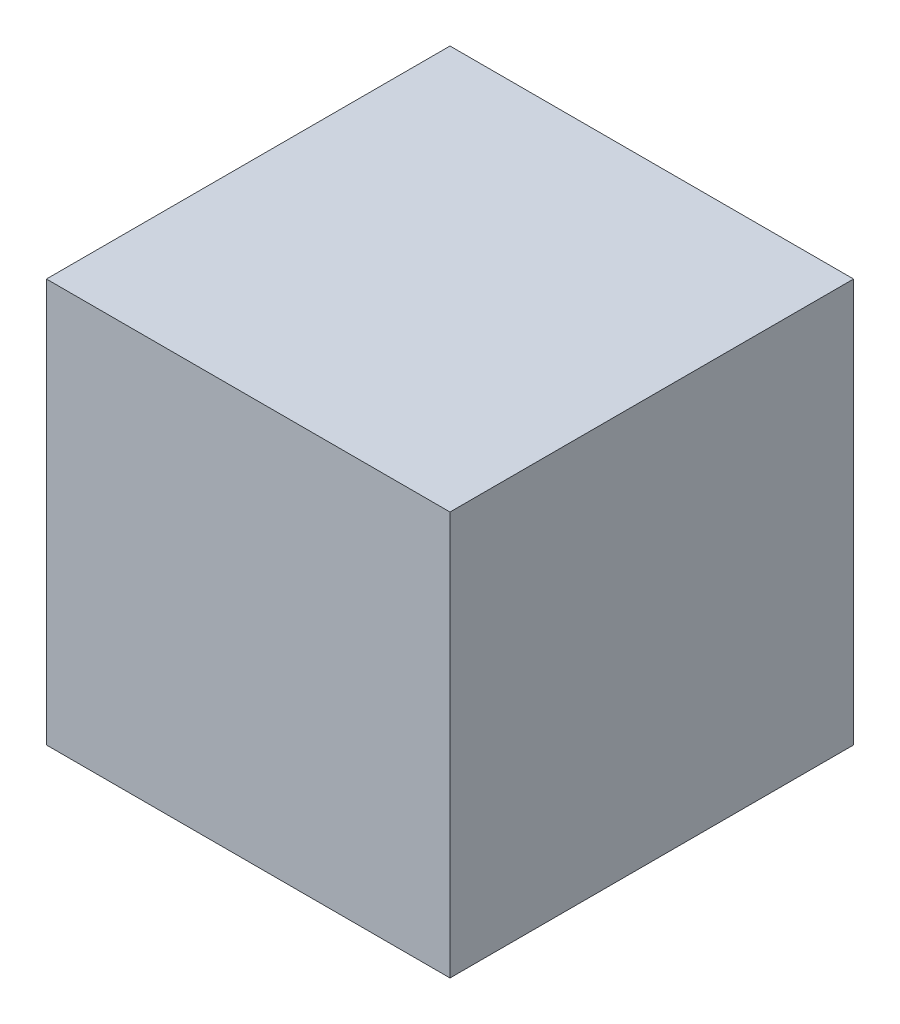
ISO-10303-21;
HEADER;
FILE_DESCRIPTION(('STEP AP214'),'2;1');
FILE_NAME('part.step','',(''),(''),'','','');
FILE_SCHEMA(('AUTOMOTIVE_DESIGN { 1 0 10303 214 1 1 1 1 }'));
ENDSEC;
DATA;
#1=APPLICATION_CONTEXT('core data for automotive mechanical design processes');
#2=APPLICATION_PROTOCOL_DEFINITION('international standard','automotive_design',2000,#1);
#3=PRODUCT_CONTEXT('',#1,'mechanical');
#4=PRODUCT('Part','Part','',(#3));
#5=PRODUCT_RELATED_PRODUCT_CATEGORY('part','',(#4));
#6=PRODUCT_DEFINITION_FORMATION('','',#4);
#7=PRODUCT_DEFINITION_CONTEXT('part definition',#1,'design');
#8=PRODUCT_DEFINITION('design','',#6,#7);
#9=PRODUCT_DEFINITION_SHAPE('','',#8);
#10=(LENGTH_UNIT() NAMED_UNIT(*) SI_UNIT(.MILLI.,.METRE.));
#11=(NAMED_UNIT(*) PLANE_ANGLE_UNIT() SI_UNIT($,.RADIAN.));
#12=(NAMED_UNIT(*) SI_UNIT($,.STERADIAN.) SOLID_ANGLE_UNIT());
#13=UNCERTAINTY_MEASURE_WITH_UNIT(LENGTH_MEASURE(1.E-05),#10,'distance_accuracy_value','');
#14=(GEOMETRIC_REPRESENTATION_CONTEXT(3) GLOBAL_UNCERTAINTY_ASSIGNED_CONTEXT((#13)) GLOBAL_UNIT_ASSIGNED_CONTEXT((#10,
#11,#12)) REPRESENTATION_CONTEXT('',''));
#15=CARTESIAN_POINT('',(0.,0.,0.));
#16=DIRECTION('',(0.,0.,1.));
#17=DIRECTION('',(1.,0.,0.));
#18=AXIS2_PLACEMENT_3D('',#15,#16,#17);
#19=CARTESIAN_POINT('',(150.,300.,-150.));
#20=DIRECTION('',(-1.,0.,0.));
#21=DIRECTION('',(0.,0.,1.));
#22=AXIS2_PLACEMENT_3D('',#19,#20,#21);
#23=PLANE('',#22);
#24=DIRECTION('',(0.,0.,-1.));
#25=VECTOR('',#24,1.);
#26=CARTESIAN_POINT('',(150.,0.,-150.));
#27=LINE('',#26,#25);
#28=CARTESIAN_POINT('',(150.,0.,150.));
#29=VERTEX_POINT('',#28);
#30=CARTESIAN_POINT('',(150.,0.,-150.));
#31=VERTEX_POINT('',#30);
#32=EDGE_CURVE('E96',#29,#31,#27,.T.);
#33=ORIENTED_EDGE('',*,*,#32,.T.);
#34=DIRECTION('',(0.,-1.,0.));
#35=VECTOR('',#34,1.);
#36=CARTESIAN_POINT('',(150.,300.,-150.));
#37=LINE('',#36,#35);
#38=CARTESIAN_POINT('',(150.,300.,-150.));
#39=VERTEX_POINT('',#38);
#40=EDGE_CURVE('E11',#39,#31,#37,.T.);
#41=ORIENTED_EDGE('',*,*,#40,.F.);
#42=DIRECTION('',(0.,0.,-1.));
#43=VECTOR('',#42,1.);
#44=CARTESIAN_POINT('',(150.,300.,-150.));
#45=LINE('',#44,#43);
#46=CARTESIAN_POINT('',(150.,300.,150.));
#47=VERTEX_POINT('',#46);
#48=EDGE_CURVE('E84',#47,#39,#45,.T.);
#49=ORIENTED_EDGE('',*,*,#48,.F.);
#50=DIRECTION('',(0.,-1.,0.));
#51=VECTOR('',#50,1.);
#52=CARTESIAN_POINT('',(150.,300.,150.));
#53=LINE('',#52,#51);
#54=EDGE_CURVE('E92',#47,#29,#53,.T.);
#55=ORIENTED_EDGE('',*,*,#54,.T.);
#56=EDGE_LOOP('',(#33,#41,#49,#55));
#57=FACE_BOUND('',#56,.T.);
#58=ADVANCED_FACE('F33',(#57),#23,.F.);
#59=CARTESIAN_POINT('',(-150.,300.,-150.));
#60=DIRECTION('',(0.,0.,1.));
#61=DIRECTION('',(1.,0.,0.));
#62=AXIS2_PLACEMENT_3D('',#59,#60,#61);
#63=PLANE('',#62);
#64=DIRECTION('',(-1.,0.,0.));
#65=VECTOR('',#64,1.);
#66=CARTESIAN_POINT('',(-150.,0.,-150.));
#67=LINE('',#66,#65);
#68=CARTESIAN_POINT('',(-150.,0.,-150.));
#69=VERTEX_POINT('',#68);
#70=EDGE_CURVE('E88',#31,#69,#67,.T.);
#71=ORIENTED_EDGE('',*,*,#70,.T.);
#72=DIRECTION('',(0.,-1.,0.));
#73=VECTOR('',#72,1.);
#74=CARTESIAN_POINT('',(-150.,300.,-150.));
#75=LINE('',#74,#73);
#76=CARTESIAN_POINT('',(-150.,300.,-150.));
#77=VERTEX_POINT('',#76);
#78=EDGE_CURVE('E41',#77,#69,#75,.T.);
#79=ORIENTED_EDGE('',*,*,#78,.F.);
#80=DIRECTION('',(-1.,0.,0.));
#81=VECTOR('',#80,1.);
#82=CARTESIAN_POINT('',(-150.,300.,-150.));
#83=LINE('',#82,#81);
#84=EDGE_CURVE('E79',#39,#77,#83,.T.);
#85=ORIENTED_EDGE('',*,*,#84,.F.);
#86=ORIENTED_EDGE('',*,*,#40,.T.);
#87=EDGE_LOOP('',(#71,#79,#85,#86));
#88=FACE_BOUND('',#87,.T.);
#89=ADVANCED_FACE('F87',(#88),#63,.F.);
#90=CARTESIAN_POINT('',(-150.,300.,-150.));
#91=DIRECTION('',(1.,0.,0.));
#92=DIRECTION('',(0.,0.,-1.));
#93=AXIS2_PLACEMENT_3D('',#90,#91,#92);
#94=PLANE('',#93);
#95=DIRECTION('',(0.,0.,1.));
#96=VECTOR('',#95,1.);
#97=CARTESIAN_POINT('',(-150.,0.,-150.));
#98=LINE('',#97,#96);
#99=CARTESIAN_POINT('',(-150.,0.,150.));
#100=VERTEX_POINT('',#99);
#101=EDGE_CURVE('E66',#69,#100,#98,.T.);
#102=ORIENTED_EDGE('',*,*,#101,.T.);
#103=DIRECTION('',(0.,-1.,0.));
#104=VECTOR('',#103,1.);
#105=CARTESIAN_POINT('',(-150.,300.,150.));
#106=LINE('',#105,#104);
#107=CARTESIAN_POINT('',(-150.,300.,150.));
#108=VERTEX_POINT('',#107);
#109=EDGE_CURVE('E89',#108,#100,#106,.T.);
#110=ORIENTED_EDGE('',*,*,#109,.F.);
#111=DIRECTION('',(0.,0.,1.));
#112=VECTOR('',#111,1.);
#113=CARTESIAN_POINT('',(-150.,300.,-150.));
#114=LINE('',#113,#112);
#115=EDGE_CURVE('E82',#77,#108,#114,.T.);
#116=ORIENTED_EDGE('',*,*,#115,.F.);
#117=ORIENTED_EDGE('',*,*,#78,.T.);
#118=EDGE_LOOP('',(#102,#110,#116,#117));
#119=FACE_BOUND('',#118,.T.);
#120=ADVANCED_FACE('F90',(#119),#94,.F.);
#121=CARTESIAN_POINT('',(-150.,300.,150.));
#122=DIRECTION('',(0.,0.,-1.));
#123=DIRECTION('',(-1.,0.,0.));
#124=AXIS2_PLACEMENT_3D('',#121,#122,#123);
#125=PLANE('',#124);
#126=DIRECTION('',(1.,0.,0.));
#127=VECTOR('',#126,1.);
#128=CARTESIAN_POINT('',(-150.,0.,150.));
#129=LINE('',#128,#127);
#130=EDGE_CURVE('E72',#100,#29,#129,.T.);
#131=ORIENTED_EDGE('',*,*,#130,.T.);
#132=ORIENTED_EDGE('',*,*,#54,.F.);
#133=DIRECTION('',(1.,0.,0.));
#134=VECTOR('',#133,1.);
#135=CARTESIAN_POINT('',(-150.,300.,150.));
#136=LINE('',#135,#134);
#137=EDGE_CURVE('E49',#108,#47,#136,.T.);
#138=ORIENTED_EDGE('',*,*,#137,.F.);
#139=ORIENTED_EDGE('',*,*,#109,.T.);
#140=EDGE_LOOP('',(#131,#132,#138,#139));
#141=FACE_BOUND('',#140,.T.);
#142=ADVANCED_FACE('F103',(#141),#125,.F.);
#143=CARTESIAN_POINT('',(0.,300.,0.));
#144=DIRECTION('',(0.,1.,0.));
#145=DIRECTION('',(0.,0.,1.));
#146=AXIS2_PLACEMENT_3D('',#143,#144,#145);
#147=PLANE('',#146);
#148=ORIENTED_EDGE('',*,*,#48,.T.);
#149=ORIENTED_EDGE('',*,*,#84,.T.);
#150=ORIENTED_EDGE('',*,*,#115,.T.);
#151=ORIENTED_EDGE('',*,*,#137,.T.);
#152=EDGE_LOOP('',(#148,#149,#150,#151));
#153=FACE_BOUND('',#152,.T.);
#154=ADVANCED_FACE('F80',(#153),#147,.T.);
#155=CARTESIAN_POINT('',(0.,0.,0.));
#156=DIRECTION('',(0.,1.,0.));
#157=DIRECTION('',(0.,0.,1.));
#158=AXIS2_PLACEMENT_3D('',#155,#156,#157);
#159=PLANE('',#158);
#160=ORIENTED_EDGE('',*,*,#32,.F.);
#161=ORIENTED_EDGE('',*,*,#130,.F.);
#162=ORIENTED_EDGE('',*,*,#101,.F.);
#163=ORIENTED_EDGE('',*,*,#70,.F.);
#164=EDGE_LOOP('',(#160,#161,#162,#163));
#165=FACE_BOUND('',#164,.T.);
#166=ADVANCED_FACE('F106',(#165),#159,.F.);
#167=CLOSED_SHELL('',(#58,#89,#120,#142,#154,#166));
#168=MANIFOLD_SOLID_BREP('B2',#167);
#169=ADVANCED_BREP_SHAPE_REPRESENTATION('',(#18,#168),#14);
#170=SHAPE_DEFINITION_REPRESENTATION(#9,#169);
ENDSEC;
END-ISO-10303-21;
